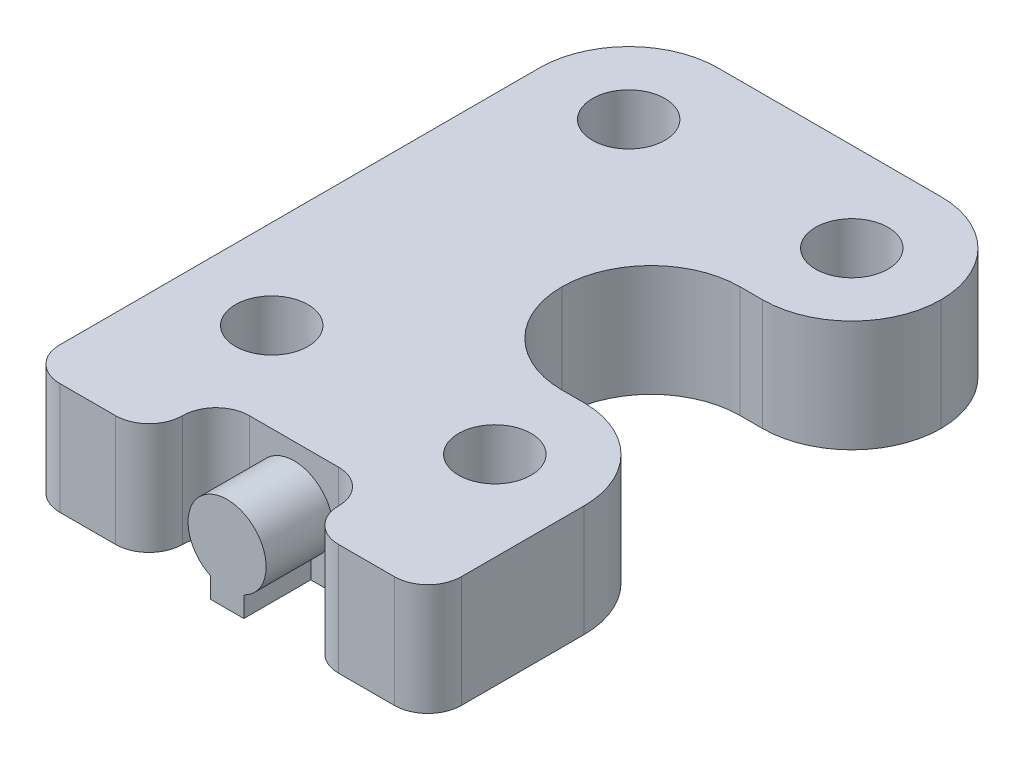
ISO-10303-21;
HEADER;
FILE_DESCRIPTION(('STEP AP214'),'2;1');
FILE_NAME('part.step','',(''),(''),'','','');
FILE_SCHEMA(('AUTOMOTIVE_DESIGN { 1 0 10303 214 1 1 1 1 }'));
ENDSEC;
DATA;
#1=APPLICATION_CONTEXT('core data for automotive mechanical design processes');
#2=APPLICATION_PROTOCOL_DEFINITION('international standard','automotive_design',2000,#1);
#3=PRODUCT_CONTEXT('',#1,'mechanical');
#4=PRODUCT('Part','Part','',(#3));
#5=PRODUCT_RELATED_PRODUCT_CATEGORY('part','',(#4));
#6=PRODUCT_DEFINITION_FORMATION('','',#4);
#7=PRODUCT_DEFINITION_CONTEXT('part definition',#1,'design');
#8=PRODUCT_DEFINITION('design','',#6,#7);
#9=PRODUCT_DEFINITION_SHAPE('','',#8);
#10=(LENGTH_UNIT() NAMED_UNIT(*) SI_UNIT(.MILLI.,.METRE.));
#11=(NAMED_UNIT(*) PLANE_ANGLE_UNIT() SI_UNIT($,.RADIAN.));
#12=(NAMED_UNIT(*) SI_UNIT($,.STERADIAN.) SOLID_ANGLE_UNIT());
#13=UNCERTAINTY_MEASURE_WITH_UNIT(LENGTH_MEASURE(1.E-05),#10,'distance_accuracy_value','');
#14=(GEOMETRIC_REPRESENTATION_CONTEXT(3) GLOBAL_UNCERTAINTY_ASSIGNED_CONTEXT((#13)) GLOBAL_UNIT_ASSIGNED_CONTEXT((#10,
#11,#12)) REPRESENTATION_CONTEXT('',''));
#15=CARTESIAN_POINT('',(0.,0.,0.));
#16=DIRECTION('',(0.,0.,1.));
#17=DIRECTION('',(1.,0.,0.));
#18=AXIS2_PLACEMENT_3D('',#15,#16,#17);
#19=CARTESIAN_POINT('',(0.,5.,0.));
#20=DIRECTION('',(0.,-1.,0.));
#21=DIRECTION('',(0.,0.,-1.));
#22=AXIS2_PLACEMENT_3D('',#19,#20,#21);
#23=PLANE('',#22);
#24=DIRECTION('',(1.,0.,0.));
#25=VECTOR('',#24,1.);
#26=CARTESIAN_POINT('',(12.5,5.,0.));
#27=LINE('',#26,#25);
#28=CARTESIAN_POINT('',(14.,5.,0.));
#29=VERTEX_POINT('',#28);
#30=CARTESIAN_POINT('',(16.5,5.,0.));
#31=VERTEX_POINT('',#30);
#32=EDGE_CURVE('E265',#29,#31,#27,.T.);
#33=ORIENTED_EDGE('',*,*,#32,.T.);
#34=CARTESIAN_POINT('',(16.5,5.,-1.5));
#35=DIRECTION('',(0.,-1.,0.));
#36=DIRECTION('',(0.,0.,-1.));
#37=AXIS2_PLACEMENT_3D('',#34,#35,#36);
#38=CIRCLE('',#37,1.5);
#39=CARTESIAN_POINT('',(18.,5.,-1.5));
#40=VERTEX_POINT('',#39);
#41=EDGE_CURVE('E377',#31,#40,#38,.F.);
#42=ORIENTED_EDGE('',*,*,#41,.T.);
#43=DIRECTION('',(0.,0.,-1.));
#44=VECTOR('',#43,1.);
#45=CARTESIAN_POINT('',(18.,5.,0.));
#46=LINE('',#45,#44);
#47=CARTESIAN_POINT('',(18.,5.,-7.));
#48=VERTEX_POINT('',#47);
#49=EDGE_CURVE('E268',#40,#48,#46,.T.);
#50=ORIENTED_EDGE('',*,*,#49,.T.);
#51=CARTESIAN_POINT('',(14.,5.,-7.));
#52=DIRECTION('',(0.,-1.,0.));
#53=DIRECTION('',(0.,0.,-1.));
#54=AXIS2_PLACEMENT_3D('',#51,#52,#53);
#55=CIRCLE('',#54,4.);
#56=CARTESIAN_POINT('',(14.,5.,-11.));
#57=VERTEX_POINT('',#56);
#58=EDGE_CURVE('E327',#48,#57,#55,.F.);
#59=ORIENTED_EDGE('',*,*,#58,.T.);
#60=DIRECTION('',(-1.,0.,0.));
#61=VECTOR('',#60,1.);
#62=CARTESIAN_POINT('',(18.,5.,-11.));
#63=LINE('',#62,#61);
#64=CARTESIAN_POINT('',(13.,5.,-11.));
#65=VERTEX_POINT('',#64);
#66=EDGE_CURVE('E270',#57,#65,#63,.T.);
#67=ORIENTED_EDGE('',*,*,#66,.T.);
#68=CARTESIAN_POINT('',(13.,5.,-15.));
#69=DIRECTION('',(0.,-1.,0.));
#70=DIRECTION('',(0.,0.,-1.));
#71=AXIS2_PLACEMENT_3D('',#68,#69,#70);
#72=CIRCLE('',#71,4.);
#73=CARTESIAN_POINT('',(9.,5.,-15.));
#74=VERTEX_POINT('',#73);
#75=EDGE_CURVE('E339',#65,#74,#72,.T.);
#76=ORIENTED_EDGE('',*,*,#75,.T.);
#77=CARTESIAN_POINT('',(13.,5.,-15.));
#78=DIRECTION('',(0.,-1.,0.));
#79=DIRECTION('',(0.,0.,-1.));
#80=AXIS2_PLACEMENT_3D('',#77,#78,#79);
#81=CIRCLE('',#80,4.);
#82=CARTESIAN_POINT('',(13.,5.,-19.));
#83=VERTEX_POINT('',#82);
#84=EDGE_CURVE('E343',#74,#83,#81,.T.);
#85=ORIENTED_EDGE('',*,*,#84,.T.);
#86=DIRECTION('',(1.,0.,0.));
#87=VECTOR('',#86,1.);
#88=CARTESIAN_POINT('',(18.,5.,-19.));
#89=LINE('',#88,#87);
#90=CARTESIAN_POINT('',(14.,5.,-19.));
#91=VERTEX_POINT('',#90);
#92=EDGE_CURVE('E273',#83,#91,#89,.T.);
#93=ORIENTED_EDGE('',*,*,#92,.T.);
#94=CARTESIAN_POINT('',(14.,5.,-23.));
#95=DIRECTION('',(0.,-1.,0.));
#96=DIRECTION('',(0.,0.,-1.));
#97=AXIS2_PLACEMENT_3D('',#94,#95,#96);
#98=CIRCLE('',#97,4.);
#99=CARTESIAN_POINT('',(18.,5.,-23.));
#100=VERTEX_POINT('',#99);
#101=EDGE_CURVE('E321',#91,#100,#98,.F.);
#102=ORIENTED_EDGE('',*,*,#101,.T.);
#103=CARTESIAN_POINT('',(14.,5.,-23.));
#104=DIRECTION('',(0.,-1.,0.));
#105=DIRECTION('',(0.,0.,-1.));
#106=AXIS2_PLACEMENT_3D('',#103,#104,#105);
#107=CIRCLE('',#106,4.);
#108=CARTESIAN_POINT('',(14.,5.,-27.));
#109=VERTEX_POINT('',#108);
#110=EDGE_CURVE('E323',#100,#109,#107,.F.);
#111=ORIENTED_EDGE('',*,*,#110,.T.);
#112=DIRECTION('',(-1.,0.,0.));
#113=VECTOR('',#112,1.);
#114=CARTESIAN_POINT('',(0.,5.,-27.));
#115=LINE('',#114,#113);
#116=CARTESIAN_POINT('',(4.,5.,-27.));
#117=VERTEX_POINT('',#116);
#118=EDGE_CURVE('E276',#109,#117,#115,.T.);
#119=ORIENTED_EDGE('',*,*,#118,.T.);
#120=CARTESIAN_POINT('',(4.,5.,-23.));
#121=DIRECTION('',(0.,-1.,0.));
#122=DIRECTION('',(0.,0.,-1.));
#123=AXIS2_PLACEMENT_3D('',#120,#121,#122);
#124=CIRCLE('',#123,4.);
#125=CARTESIAN_POINT('',(0.,5.,-23.));
#126=VERTEX_POINT('',#125);
#127=EDGE_CURVE('E325',#117,#126,#124,.F.);
#128=ORIENTED_EDGE('',*,*,#127,.T.);
#129=DIRECTION('',(0.,0.,1.));
#130=VECTOR('',#129,1.);
#131=CARTESIAN_POINT('',(0.,5.,0.));
#132=LINE('',#131,#130);
#133=CARTESIAN_POINT('',(0.,5.,-1.5));
#134=VERTEX_POINT('',#133);
#135=EDGE_CURVE('E255',#126,#134,#132,.T.);
#136=ORIENTED_EDGE('',*,*,#135,.T.);
#137=CARTESIAN_POINT('',(1.5,5.,-1.5));
#138=DIRECTION('',(0.,-1.,0.));
#139=DIRECTION('',(0.,0.,-1.));
#140=AXIS2_PLACEMENT_3D('',#137,#138,#139);
#141=CIRCLE('',#140,1.5);
#142=CARTESIAN_POINT('',(1.5,5.,0.));
#143=VERTEX_POINT('',#142);
#144=EDGE_CURVE('E371',#134,#143,#141,.F.);
#145=ORIENTED_EDGE('',*,*,#144,.T.);
#146=DIRECTION('',(1.,0.,0.));
#147=VECTOR('',#146,1.);
#148=CARTESIAN_POINT('',(0.,5.,0.));
#149=LINE('',#148,#147);
#150=CARTESIAN_POINT('',(4.,5.,0.));
#151=VERTEX_POINT('',#150);
#152=EDGE_CURVE('E258',#143,#151,#149,.T.);
#153=ORIENTED_EDGE('',*,*,#152,.T.);
#154=CARTESIAN_POINT('',(4.,5.,-1.5));
#155=DIRECTION('',(0.,-1.,0.));
#156=DIRECTION('',(0.,0.,-1.));
#157=AXIS2_PLACEMENT_3D('',#154,#155,#156);
#158=CIRCLE('',#157,1.5);
#159=CARTESIAN_POINT('',(5.5,5.,-1.5));
#160=VERTEX_POINT('',#159);
#161=EDGE_CURVE('E373',#151,#160,#158,.F.);
#162=ORIENTED_EDGE('',*,*,#161,.T.);
#163=CARTESIAN_POINT('',(7.,5.,-1.5));
#164=DIRECTION('',(0.,-1.,0.));
#165=DIRECTION('',(0.,0.,-1.));
#166=AXIS2_PLACEMENT_3D('',#163,#164,#165);
#167=CIRCLE('',#166,1.5);
#168=CARTESIAN_POINT('',(7.,5.,-3.));
#169=VERTEX_POINT('',#168);
#170=EDGE_CURVE('E11',#160,#169,#167,.T.);
#171=ORIENTED_EDGE('',*,*,#170,.T.);
#172=DIRECTION('',(1.,0.,0.));
#173=VECTOR('',#172,1.);
#174=CARTESIAN_POINT('',(5.5,5.,-3.));
#175=LINE('',#174,#173);
#176=CARTESIAN_POINT('',(11.,5.,-3.));
#177=VERTEX_POINT('',#176);
#178=EDGE_CURVE('E262',#169,#177,#175,.T.);
#179=ORIENTED_EDGE('',*,*,#178,.T.);
#180=CARTESIAN_POINT('',(11.,5.,-1.5));
#181=DIRECTION('',(0.,-1.,0.));
#182=DIRECTION('',(0.,0.,-1.));
#183=AXIS2_PLACEMENT_3D('',#180,#181,#182);
#184=CIRCLE('',#183,1.5);
#185=CARTESIAN_POINT('',(12.5,5.,-1.5));
#186=VERTEX_POINT('',#185);
#187=EDGE_CURVE('E389',#177,#186,#184,.T.);
#188=ORIENTED_EDGE('',*,*,#187,.T.);
#189=CARTESIAN_POINT('',(14.,5.,-1.5));
#190=DIRECTION('',(0.,-1.,0.));
#191=DIRECTION('',(0.,0.,-1.));
#192=AXIS2_PLACEMENT_3D('',#189,#190,#191);
#193=CIRCLE('',#192,1.5);
#194=EDGE_CURVE('E375',#186,#29,#193,.F.);
#195=ORIENTED_EDGE('',*,*,#194,.T.);
#196=EDGE_LOOP('',(#33,#42,#50,#59,#67,#76,#85,#93,#102,#111,#119,#128,#136,#145,#153,#162,#171,
#179,#188,#195));
#197=FACE_BOUND('',#196,.T.);
#198=CARTESIAN_POINT('',(4.,5.,-23.));
#199=DIRECTION('',(0.,1.,0.));
#200=DIRECTION('',(0.,0.,1.));
#201=AXIS2_PLACEMENT_3D('',#198,#199,#200);
#202=CIRCLE('',#201,1.625);
#203=CARTESIAN_POINT('',(4.,5.,-21.375));
#204=VERTEX_POINT('',#203);
#205=EDGE_CURVE('E249',#204,#204,#202,.T.);
#206=ORIENTED_EDGE('',*,*,#205,.F.);
#207=EDGE_LOOP('',(#206));
#208=FACE_BOUND('',#207,.T.);
#209=CARTESIAN_POINT('',(14.,5.,-23.));
#210=DIRECTION('',(0.,1.,0.));
#211=DIRECTION('',(0.,0.,1.));
#212=AXIS2_PLACEMENT_3D('',#209,#210,#211);
#213=CIRCLE('',#212,1.625);
#214=CARTESIAN_POINT('',(14.,5.,-21.375));
#215=VERTEX_POINT('',#214);
#216=EDGE_CURVE('E243',#215,#215,#213,.T.);
#217=ORIENTED_EDGE('',*,*,#216,.F.);
#218=EDGE_LOOP('',(#217));
#219=FACE_BOUND('',#218,.T.);
#220=CARTESIAN_POINT('',(14.,5.,-7.));
#221=DIRECTION('',(0.,1.,0.));
#222=DIRECTION('',(0.,0.,1.));
#223=AXIS2_PLACEMENT_3D('',#220,#221,#222);
#224=CIRCLE('',#223,1.625);
#225=CARTESIAN_POINT('',(14.,5.,-5.375));
#226=VERTEX_POINT('',#225);
#227=EDGE_CURVE('E237',#226,#226,#224,.T.);
#228=ORIENTED_EDGE('',*,*,#227,.F.);
#229=EDGE_LOOP('',(#228));
#230=FACE_BOUND('',#229,.T.);
#231=CARTESIAN_POINT('',(4.,5.,-7.));
#232=DIRECTION('',(0.,1.,0.));
#233=DIRECTION('',(0.,0.,1.));
#234=AXIS2_PLACEMENT_3D('',#231,#232,#233);
#235=CIRCLE('',#234,1.625);
#236=CARTESIAN_POINT('',(4.,5.,-5.375));
#237=VERTEX_POINT('',#236);
#238=EDGE_CURVE('E229',#237,#237,#235,.T.);
#239=ORIENTED_EDGE('',*,*,#238,.F.);
#240=EDGE_LOOP('',(#239));
#241=FACE_BOUND('',#240,.T.);
#242=ADVANCED_FACE('F33',(#197,#208,#219,#230,#241),#23,.F.);
#243=CARTESIAN_POINT('',(0.,0.,0.));
#244=DIRECTION('',(0.,-1.,0.));
#245=DIRECTION('',(0.,0.,-1.));
#246=AXIS2_PLACEMENT_3D('',#243,#244,#245);
#247=PLANE('',#246);
#248=CARTESIAN_POINT('',(14.,0.,-7.));
#249=DIRECTION('',(0.,1.,0.));
#250=DIRECTION('',(0.,0.,1.));
#251=AXIS2_PLACEMENT_3D('',#248,#249,#250);
#252=CIRCLE('',#251,1.625);
#253=CARTESIAN_POINT('',(14.,0.,-5.375));
#254=VERTEX_POINT('',#253);
#255=EDGE_CURVE('E232',#254,#254,#252,.T.);
#256=ORIENTED_EDGE('',*,*,#255,.T.);
#257=EDGE_LOOP('',(#256));
#258=FACE_BOUND('',#257,.T.);
#259=CARTESIAN_POINT('',(4.,0.,-23.));
#260=DIRECTION('',(0.,1.,0.));
#261=DIRECTION('',(0.,0.,1.));
#262=AXIS2_PLACEMENT_3D('',#259,#260,#261);
#263=CIRCLE('',#262,1.625);
#264=CARTESIAN_POINT('',(4.,0.,-21.375));
#265=VERTEX_POINT('',#264);
#266=EDGE_CURVE('E246',#265,#265,#263,.T.);
#267=ORIENTED_EDGE('',*,*,#266,.T.);
#268=EDGE_LOOP('',(#267));
#269=FACE_BOUND('',#268,.T.);
#270=DIRECTION('',(0.,0.,-1.));
#271=VECTOR('',#270,1.);
#272=CARTESIAN_POINT('',(18.,0.,0.));
#273=LINE('',#272,#271);
#274=CARTESIAN_POINT('',(18.,0.,-1.5));
#275=VERTEX_POINT('',#274);
#276=CARTESIAN_POINT('',(18.,0.,-7.));
#277=VERTEX_POINT('',#276);
#278=EDGE_CURVE('E290',#275,#277,#273,.T.);
#279=ORIENTED_EDGE('',*,*,#278,.F.);
#280=CARTESIAN_POINT('',(16.5,0.,-1.5));
#281=DIRECTION('',(0.,-1.,0.));
#282=DIRECTION('',(0.,0.,-1.));
#283=AXIS2_PLACEMENT_3D('',#280,#281,#282);
#284=CIRCLE('',#283,1.5);
#285=CARTESIAN_POINT('',(16.5,0.,0.));
#286=VERTEX_POINT('',#285);
#287=EDGE_CURVE('E365',#275,#286,#284,.T.);
#288=ORIENTED_EDGE('',*,*,#287,.T.);
#289=DIRECTION('',(1.,0.,0.));
#290=VECTOR('',#289,1.);
#291=CARTESIAN_POINT('',(12.5,0.,0.));
#292=LINE('',#291,#290);
#293=CARTESIAN_POINT('',(14.,0.,0.));
#294=VERTEX_POINT('',#293);
#295=EDGE_CURVE('E287',#294,#286,#292,.T.);
#296=ORIENTED_EDGE('',*,*,#295,.F.);
#297=CARTESIAN_POINT('',(14.,0.,-1.5));
#298=DIRECTION('',(0.,-1.,0.));
#299=DIRECTION('',(0.,0.,-1.));
#300=AXIS2_PLACEMENT_3D('',#297,#298,#299);
#301=CIRCLE('',#300,1.5);
#302=CARTESIAN_POINT('',(12.5,0.,-1.5));
#303=VERTEX_POINT('',#302);
#304=EDGE_CURVE('E363',#294,#303,#301,.T.);
#305=ORIENTED_EDGE('',*,*,#304,.T.);
#306=CARTESIAN_POINT('',(11.,0.,-1.5));
#307=DIRECTION('',(0.,-1.,0.));
#308=DIRECTION('',(0.,0.,-1.));
#309=AXIS2_PLACEMENT_3D('',#306,#307,#308);
#310=CIRCLE('',#309,1.5);
#311=CARTESIAN_POINT('',(11.,0.,-3.));
#312=VERTEX_POINT('',#311);
#313=EDGE_CURVE('E386',#303,#312,#310,.F.);
#314=ORIENTED_EDGE('',*,*,#313,.T.);
#315=DIRECTION('',(1.,0.,0.));
#316=VECTOR('',#315,1.);
#317=CARTESIAN_POINT('',(5.5,0.,-3.));
#318=LINE('',#317,#316);
#319=CARTESIAN_POINT('',(9.75,0.,-3.));
#320=VERTEX_POINT('',#319);
#321=EDGE_CURVE('E285',#320,#312,#318,.T.);
#322=ORIENTED_EDGE('',*,*,#321,.F.);
#323=DIRECTION('',(0.,0.,-1.));
#324=VECTOR('',#323,1.);
#325=CARTESIAN_POINT('',(9.75,0.,5.50567888638631));
#326=LINE('',#325,#324);
#327=CARTESIAN_POINT('',(9.75,0.,0.));
#328=VERTEX_POINT('',#327);
#329=EDGE_CURVE('E222',#328,#320,#326,.T.);
#330=ORIENTED_EDGE('',*,*,#329,.F.);
#331=DIRECTION('',(-1.,0.,0.));
#332=VECTOR('',#331,1.);
#333=CARTESIAN_POINT('',(8.25,0.,0.));
#334=LINE('',#333,#332);
#335=CARTESIAN_POINT('',(8.25,0.,0.));
#336=VERTEX_POINT('',#335);
#337=EDGE_CURVE('E228',#328,#336,#334,.T.);
#338=ORIENTED_EDGE('',*,*,#337,.T.);
#339=DIRECTION('',(0.,0.,-1.));
#340=VECTOR('',#339,1.);
#341=CARTESIAN_POINT('',(8.25,0.,5.50567888638631));
#342=LINE('',#341,#340);
#343=CARTESIAN_POINT('',(8.25,0.,-3.));
#344=VERTEX_POINT('',#343);
#345=EDGE_CURVE('E210',#336,#344,#342,.T.);
#346=ORIENTED_EDGE('',*,*,#345,.T.);
#347=CARTESIAN_POINT('',(7.,0.,-3.));
#348=VERTEX_POINT('',#347);
#349=EDGE_CURVE('E197',#348,#344,#318,.T.);
#350=ORIENTED_EDGE('',*,*,#349,.F.);
#351=CARTESIAN_POINT('',(7.,0.,-1.5));
#352=DIRECTION('',(0.,-1.,0.));
#353=DIRECTION('',(0.,0.,-1.));
#354=AXIS2_PLACEMENT_3D('',#351,#352,#353);
#355=CIRCLE('',#354,1.5);
#356=CARTESIAN_POINT('',(5.5,0.,-1.5));
#357=VERTEX_POINT('',#356);
#358=EDGE_CURVE('E42',#348,#357,#355,.F.);
#359=ORIENTED_EDGE('',*,*,#358,.T.);
#360=CARTESIAN_POINT('',(4.,0.,-1.5));
#361=DIRECTION('',(0.,-1.,0.));
#362=DIRECTION('',(0.,0.,-1.));
#363=AXIS2_PLACEMENT_3D('',#360,#361,#362);
#364=CIRCLE('',#363,1.5);
#365=CARTESIAN_POINT('',(4.,0.,0.));
#366=VERTEX_POINT('',#365);
#367=EDGE_CURVE('E361',#357,#366,#364,.T.);
#368=ORIENTED_EDGE('',*,*,#367,.T.);
#369=DIRECTION('',(1.,0.,0.));
#370=VECTOR('',#369,1.);
#371=CARTESIAN_POINT('',(0.,0.,0.));
#372=LINE('',#371,#370);
#373=CARTESIAN_POINT('',(1.5,0.,0.));
#374=VERTEX_POINT('',#373);
#375=EDGE_CURVE('E282',#374,#366,#372,.T.);
#376=ORIENTED_EDGE('',*,*,#375,.F.);
#377=CARTESIAN_POINT('',(1.5,0.,-1.5));
#378=DIRECTION('',(0.,-1.,0.));
#379=DIRECTION('',(0.,0.,-1.));
#380=AXIS2_PLACEMENT_3D('',#377,#378,#379);
#381=CIRCLE('',#380,1.5);
#382=CARTESIAN_POINT('',(0.,0.,-1.5));
#383=VERTEX_POINT('',#382);
#384=EDGE_CURVE('E359',#374,#383,#381,.T.);
#385=ORIENTED_EDGE('',*,*,#384,.T.);
#386=DIRECTION('',(0.,0.,1.));
#387=VECTOR('',#386,1.);
#388=CARTESIAN_POINT('',(0.,0.,0.));
#389=LINE('',#388,#387);
#390=CARTESIAN_POINT('',(0.,0.,-23.));
#391=VERTEX_POINT('',#390);
#392=EDGE_CURVE('E252',#391,#383,#389,.T.);
#393=ORIENTED_EDGE('',*,*,#392,.F.);
#394=CARTESIAN_POINT('',(4.,0.,-23.));
#395=DIRECTION('',(0.,-1.,0.));
#396=DIRECTION('',(0.,0.,-1.));
#397=AXIS2_PLACEMENT_3D('',#394,#395,#396);
#398=CIRCLE('',#397,4.);
#399=CARTESIAN_POINT('',(4.,0.,-27.));
#400=VERTEX_POINT('',#399);
#401=EDGE_CURVE('E313',#391,#400,#398,.T.);
#402=ORIENTED_EDGE('',*,*,#401,.T.);
#403=DIRECTION('',(-1.,0.,0.));
#404=VECTOR('',#403,1.);
#405=CARTESIAN_POINT('',(0.,0.,-27.));
#406=LINE('',#405,#404);
#407=CARTESIAN_POINT('',(14.,0.,-27.));
#408=VERTEX_POINT('',#407);
#409=EDGE_CURVE('E259',#408,#400,#406,.T.);
#410=ORIENTED_EDGE('',*,*,#409,.F.);
#411=CARTESIAN_POINT('',(14.,0.,-23.));
#412=DIRECTION('',(0.,-1.,0.));
#413=DIRECTION('',(0.,0.,-1.));
#414=AXIS2_PLACEMENT_3D('',#411,#412,#413);
#415=CIRCLE('',#414,4.);
#416=CARTESIAN_POINT('',(18.,0.,-23.));
#417=VERTEX_POINT('',#416);
#418=EDGE_CURVE('E311',#408,#417,#415,.T.);
#419=ORIENTED_EDGE('',*,*,#418,.T.);
#420=CARTESIAN_POINT('',(14.,0.,-23.));
#421=DIRECTION('',(0.,-1.,0.));
#422=DIRECTION('',(0.,0.,-1.));
#423=AXIS2_PLACEMENT_3D('',#420,#421,#422);
#424=CIRCLE('',#423,4.);
#425=CARTESIAN_POINT('',(14.,0.,-19.));
#426=VERTEX_POINT('',#425);
#427=EDGE_CURVE('E309',#417,#426,#424,.T.);
#428=ORIENTED_EDGE('',*,*,#427,.T.);
#429=DIRECTION('',(1.,0.,0.));
#430=VECTOR('',#429,1.);
#431=CARTESIAN_POINT('',(18.,0.,-19.));
#432=LINE('',#431,#430);
#433=CARTESIAN_POINT('',(13.,0.,-19.));
#434=VERTEX_POINT('',#433);
#435=EDGE_CURVE('E295',#434,#426,#432,.T.);
#436=ORIENTED_EDGE('',*,*,#435,.F.);
#437=CARTESIAN_POINT('',(13.,0.,-15.));
#438=DIRECTION('',(0.,-1.,0.));
#439=DIRECTION('',(0.,0.,-1.));
#440=AXIS2_PLACEMENT_3D('',#437,#438,#439);
#441=CIRCLE('',#440,4.);
#442=CARTESIAN_POINT('',(9.,0.,-15.));
#443=VERTEX_POINT('',#442);
#444=EDGE_CURVE('E341',#434,#443,#441,.F.);
#445=ORIENTED_EDGE('',*,*,#444,.T.);
#446=CARTESIAN_POINT('',(13.,0.,-15.));
#447=DIRECTION('',(0.,-1.,0.));
#448=DIRECTION('',(0.,0.,-1.));
#449=AXIS2_PLACEMENT_3D('',#446,#447,#448);
#450=CIRCLE('',#449,4.);
#451=CARTESIAN_POINT('',(13.,0.,-11.));
#452=VERTEX_POINT('',#451);
#453=EDGE_CURVE('E337',#443,#452,#450,.F.);
#454=ORIENTED_EDGE('',*,*,#453,.T.);
#455=DIRECTION('',(-1.,0.,0.));
#456=VECTOR('',#455,1.);
#457=CARTESIAN_POINT('',(18.,0.,-11.));
#458=LINE('',#457,#456);
#459=CARTESIAN_POINT('',(14.,0.,-11.));
#460=VERTEX_POINT('',#459);
#461=EDGE_CURVE('E292',#460,#452,#458,.T.);
#462=ORIENTED_EDGE('',*,*,#461,.F.);
#463=CARTESIAN_POINT('',(14.,0.,-7.));
#464=DIRECTION('',(0.,-1.,0.));
#465=DIRECTION('',(0.,0.,-1.));
#466=AXIS2_PLACEMENT_3D('',#463,#464,#465);
#467=CIRCLE('',#466,4.);
#468=EDGE_CURVE('E315',#460,#277,#467,.T.);
#469=ORIENTED_EDGE('',*,*,#468,.T.);
#470=EDGE_LOOP('',(#279,#288,#296,#305,#314,#322,#330,#338,#346,#350,#359,#368,#376,#385,#393,
#402,#410,#419,#428,#436,#445,#454,#462,#469));
#471=FACE_BOUND('',#470,.T.);
#472=CARTESIAN_POINT('',(14.,0.,-23.));
#473=DIRECTION('',(0.,1.,0.));
#474=DIRECTION('',(0.,0.,1.));
#475=AXIS2_PLACEMENT_3D('',#472,#473,#474);
#476=CIRCLE('',#475,1.625);
#477=CARTESIAN_POINT('',(14.,0.,-21.375));
#478=VERTEX_POINT('',#477);
#479=EDGE_CURVE('E240',#478,#478,#476,.T.);
#480=ORIENTED_EDGE('',*,*,#479,.T.);
#481=EDGE_LOOP('',(#480));
#482=FACE_BOUND('',#481,.T.);
#483=CARTESIAN_POINT('',(4.,0.,-7.));
#484=DIRECTION('',(0.,1.,0.));
#485=DIRECTION('',(0.,0.,1.));
#486=AXIS2_PLACEMENT_3D('',#483,#484,#485);
#487=CIRCLE('',#486,1.625);
#488=CARTESIAN_POINT('',(4.,0.,-5.375));
#489=VERTEX_POINT('',#488);
#490=EDGE_CURVE('E233',#489,#489,#487,.T.);
#491=ORIENTED_EDGE('',*,*,#490,.T.);
#492=EDGE_LOOP('',(#491));
#493=FACE_BOUND('',#492,.T.);
#494=ADVANCED_FACE('F404',(#258,#269,#471,#482,#493),#247,.T.);
#495=CARTESIAN_POINT('',(0.,5.,0.));
#496=DIRECTION('',(1.,0.,0.));
#497=DIRECTION('',(0.,0.,-1.));
#498=AXIS2_PLACEMENT_3D('',#495,#496,#497);
#499=PLANE('',#498);
#500=ORIENTED_EDGE('',*,*,#392,.T.);
#501=DIRECTION('',(0.,-1.,0.));
#502=VECTOR('',#501,1.);
#503=CARTESIAN_POINT('',(0.,5.,-1.5));
#504=LINE('',#503,#502);
#505=EDGE_CURVE('E384',#383,#134,#504,.F.);
#506=ORIENTED_EDGE('',*,*,#505,.T.);
#507=ORIENTED_EDGE('',*,*,#135,.F.);
#508=DIRECTION('',(0.,-1.,0.));
#509=VECTOR('',#508,1.);
#510=CARTESIAN_POINT('',(0.,5.,-23.));
#511=LINE('',#510,#509);
#512=EDGE_CURVE('E329',#126,#391,#511,.T.);
#513=ORIENTED_EDGE('',*,*,#512,.T.);
#514=EDGE_LOOP('',(#500,#506,#507,#513));
#515=FACE_BOUND('',#514,.T.);
#516=ADVANCED_FACE('F426',(#515),#499,.F.);
#517=CARTESIAN_POINT('',(0.,5.,0.));
#518=DIRECTION('',(0.,0.,-1.));
#519=DIRECTION('',(-1.,0.,0.));
#520=AXIS2_PLACEMENT_3D('',#517,#518,#519);
#521=PLANE('',#520);
#522=ORIENTED_EDGE('',*,*,#375,.T.);
#523=DIRECTION('',(0.,-1.,0.));
#524=VECTOR('',#523,1.);
#525=CARTESIAN_POINT('',(4.,5.,0.));
#526=LINE('',#525,#524);
#527=EDGE_CURVE('E382',#366,#151,#526,.F.);
#528=ORIENTED_EDGE('',*,*,#527,.T.);
#529=ORIENTED_EDGE('',*,*,#152,.F.);
#530=DIRECTION('',(0.,-1.,0.));
#531=VECTOR('',#530,1.);
#532=CARTESIAN_POINT('',(1.5,5.,0.));
#533=LINE('',#532,#531);
#534=EDGE_CURVE('E379',#143,#374,#533,.T.);
#535=ORIENTED_EDGE('',*,*,#534,.T.);
#536=EDGE_LOOP('',(#522,#528,#529,#535));
#537=FACE_BOUND('',#536,.T.);
#538=ADVANCED_FACE('F456',(#537),#521,.F.);
#539=CARTESIAN_POINT('',(5.5,5.,-3.));
#540=DIRECTION('',(0.,0.,-1.));
#541=DIRECTION('',(-1.,0.,0.));
#542=AXIS2_PLACEMENT_3D('',#539,#540,#541);
#543=PLANE('',#542);
#544=DIRECTION('',(0.,1.,0.));
#545=VECTOR('',#544,1.);
#546=CARTESIAN_POINT('',(9.75,0.918861169915811,-3.));
#547=LINE('',#546,#545);
#548=CARTESIAN_POINT('',(9.75,0.91886116991581,-3.));
#549=VERTEX_POINT('',#548);
#550=EDGE_CURVE('E55',#320,#549,#547,.T.);
#551=ORIENTED_EDGE('',*,*,#550,.F.);
#552=ORIENTED_EDGE('',*,*,#321,.T.);
#553=DIRECTION('',(0.,-1.,0.));
#554=VECTOR('',#553,1.);
#555=CARTESIAN_POINT('',(11.,5.,-3.));
#556=LINE('',#555,#554);
#557=EDGE_CURVE('E353',#312,#177,#556,.F.);
#558=ORIENTED_EDGE('',*,*,#557,.T.);
#559=ORIENTED_EDGE('',*,*,#178,.F.);
#560=DIRECTION('',(0.,-1.,0.));
#561=VECTOR('',#560,1.);
#562=CARTESIAN_POINT('',(7.,0.,-3.));
#563=LINE('',#562,#561);
#564=EDGE_CURVE('E345',#169,#348,#563,.T.);
#565=ORIENTED_EDGE('',*,*,#564,.T.);
#566=ORIENTED_EDGE('',*,*,#349,.T.);
#567=DIRECTION('',(0.,-1.,0.));
#568=VECTOR('',#567,1.);
#569=CARTESIAN_POINT('',(8.25,0.91886116991581,-3.));
#570=LINE('',#569,#568);
#571=CARTESIAN_POINT('',(8.25,0.91886116991581,-3.));
#572=VERTEX_POINT('',#571);
#573=EDGE_CURVE('E192',#572,#344,#570,.T.);
#574=ORIENTED_EDGE('',*,*,#573,.F.);
#575=CARTESIAN_POINT('',(9.,2.5,-3.));
#576=DIRECTION('',(0.,0.,1.));
#577=DIRECTION('',(1.,0.,0.));
#578=AXIS2_PLACEMENT_3D('',#575,#576,#577);
#579=CIRCLE('',#578,1.75);
#580=EDGE_CURVE('E50',#549,#572,#579,.T.);
#581=ORIENTED_EDGE('',*,*,#580,.F.);
#582=EDGE_LOOP('',(#551,#552,#558,#559,#565,#566,#574,#581));
#583=FACE_BOUND('',#582,.T.);
#584=ADVANCED_FACE('F194',(#583),#543,.F.);
#585=CARTESIAN_POINT('',(12.5,5.,0.));
#586=DIRECTION('',(0.,0.,-1.));
#587=DIRECTION('',(-1.,0.,0.));
#588=AXIS2_PLACEMENT_3D('',#585,#586,#587);
#589=PLANE('',#588);
#590=ORIENTED_EDGE('',*,*,#295,.T.);
#591=DIRECTION('',(0.,-1.,0.));
#592=VECTOR('',#591,1.);
#593=CARTESIAN_POINT('',(16.5,5.,0.));
#594=LINE('',#593,#592);
#595=EDGE_CURVE('E369',#286,#31,#594,.F.);
#596=ORIENTED_EDGE('',*,*,#595,.T.);
#597=ORIENTED_EDGE('',*,*,#32,.F.);
#598=DIRECTION('',(0.,-1.,0.));
#599=VECTOR('',#598,1.);
#600=CARTESIAN_POINT('',(14.,5.,0.));
#601=LINE('',#600,#599);
#602=EDGE_CURVE('E367',#29,#294,#601,.T.);
#603=ORIENTED_EDGE('',*,*,#602,.T.);
#604=EDGE_LOOP('',(#590,#596,#597,#603));
#605=FACE_BOUND('',#604,.T.);
#606=ADVANCED_FACE('F449',(#605),#589,.F.);
#607=CARTESIAN_POINT('',(18.,5.,0.));
#608=DIRECTION('',(-1.,0.,0.));
#609=DIRECTION('',(0.,0.,1.));
#610=AXIS2_PLACEMENT_3D('',#607,#608,#609);
#611=PLANE('',#610);
#612=ORIENTED_EDGE('',*,*,#49,.F.);
#613=DIRECTION('',(0.,-1.,0.));
#614=VECTOR('',#613,1.);
#615=CARTESIAN_POINT('',(18.,5.,-1.5));
#616=LINE('',#615,#614);
#617=EDGE_CURVE('E356',#40,#275,#616,.T.);
#618=ORIENTED_EDGE('',*,*,#617,.T.);
#619=ORIENTED_EDGE('',*,*,#278,.T.);
#620=DIRECTION('',(0.,-1.,0.));
#621=VECTOR('',#620,1.);
#622=CARTESIAN_POINT('',(18.,5.,-7.));
#623=LINE('',#622,#621);
#624=EDGE_CURVE('E318',#277,#48,#623,.F.);
#625=ORIENTED_EDGE('',*,*,#624,.T.);
#626=EDGE_LOOP('',(#612,#618,#619,#625));
#627=FACE_BOUND('',#626,.T.);
#628=ADVANCED_FACE('F445',(#627),#611,.F.);
#629=CARTESIAN_POINT('',(18.,5.,-11.));
#630=DIRECTION('',(0.,0.,1.));
#631=DIRECTION('',(1.,0.,0.));
#632=AXIS2_PLACEMENT_3D('',#629,#630,#631);
#633=PLANE('',#632);
#634=ORIENTED_EDGE('',*,*,#461,.T.);
#635=DIRECTION('',(0.,-1.,0.));
#636=VECTOR('',#635,1.);
#637=CARTESIAN_POINT('',(13.,5.,-11.));
#638=LINE('',#637,#636);
#639=EDGE_CURVE('E302',#452,#65,#638,.F.);
#640=ORIENTED_EDGE('',*,*,#639,.T.);
#641=ORIENTED_EDGE('',*,*,#66,.F.);
#642=DIRECTION('',(0.,-1.,0.));
#643=VECTOR('',#642,1.);
#644=CARTESIAN_POINT('',(14.,5.,-11.));
#645=LINE('',#644,#643);
#646=EDGE_CURVE('E279',#57,#460,#645,.T.);
#647=ORIENTED_EDGE('',*,*,#646,.T.);
#648=EDGE_LOOP('',(#634,#640,#641,#647));
#649=FACE_BOUND('',#648,.T.);
#650=ADVANCED_FACE('F441',(#649),#633,.F.);
#651=CARTESIAN_POINT('',(18.,5.,-19.));
#652=DIRECTION('',(0.,0.,-1.));
#653=DIRECTION('',(-1.,0.,0.));
#654=AXIS2_PLACEMENT_3D('',#651,#652,#653);
#655=PLANE('',#654);
#656=ORIENTED_EDGE('',*,*,#92,.F.);
#657=DIRECTION('',(0.,-1.,0.));
#658=VECTOR('',#657,1.);
#659=CARTESIAN_POINT('',(13.,0.,-19.));
#660=LINE('',#659,#658);
#661=EDGE_CURVE('E307',#83,#434,#660,.T.);
#662=ORIENTED_EDGE('',*,*,#661,.T.);
#663=ORIENTED_EDGE('',*,*,#435,.T.);
#664=DIRECTION('',(0.,-1.,0.));
#665=VECTOR('',#664,1.);
#666=CARTESIAN_POINT('',(14.,5.,-19.));
#667=LINE('',#666,#665);
#668=EDGE_CURVE('E305',#426,#91,#667,.F.);
#669=ORIENTED_EDGE('',*,*,#668,.T.);
#670=EDGE_LOOP('',(#656,#662,#663,#669));
#671=FACE_BOUND('',#670,.T.);
#672=ADVANCED_FACE('F437',(#671),#655,.F.);
#673=CARTESIAN_POINT('',(0.,5.,-27.));
#674=DIRECTION('',(0.,0.,1.));
#675=DIRECTION('',(1.,0.,0.));
#676=AXIS2_PLACEMENT_3D('',#673,#674,#675);
#677=PLANE('',#676);
#678=ORIENTED_EDGE('',*,*,#409,.T.);
#679=DIRECTION('',(0.,-1.,0.));
#680=VECTOR('',#679,1.);
#681=CARTESIAN_POINT('',(4.,5.,-27.));
#682=LINE('',#681,#680);
#683=EDGE_CURVE('E335',#400,#117,#682,.F.);
#684=ORIENTED_EDGE('',*,*,#683,.T.);
#685=ORIENTED_EDGE('',*,*,#118,.F.);
#686=DIRECTION('',(0.,-1.,0.));
#687=VECTOR('',#686,1.);
#688=CARTESIAN_POINT('',(14.,5.,-27.));
#689=LINE('',#688,#687);
#690=EDGE_CURVE('E332',#109,#408,#689,.T.);
#691=ORIENTED_EDGE('',*,*,#690,.T.);
#692=EDGE_LOOP('',(#678,#684,#685,#691));
#693=FACE_BOUND('',#692,.T.);
#694=ADVANCED_FACE('F434',(#693),#677,.F.);
#695=CARTESIAN_POINT('',(4.,5.,-23.));
#696=DIRECTION('',(0.,-1.,0.));
#697=DIRECTION('',(0.,0.,-1.));
#698=AXIS2_PLACEMENT_3D('',#695,#696,#697);
#699=CYLINDRICAL_SURFACE('',#698,1.625);
#700=ORIENTED_EDGE('',*,*,#205,.T.);
#701=EDGE_LOOP('',(#700));
#702=FACE_BOUND('',#701,.T.);
#703=ORIENTED_EDGE('',*,*,#266,.F.);
#704=EDGE_LOOP('',(#703));
#705=FACE_BOUND('',#704,.T.);
#706=ADVANCED_FACE('F431',(#702,#705),#699,.F.);
#707=CARTESIAN_POINT('',(14.,5.,-23.));
#708=DIRECTION('',(0.,-1.,0.));
#709=DIRECTION('',(0.,0.,-1.));
#710=AXIS2_PLACEMENT_3D('',#707,#708,#709);
#711=CYLINDRICAL_SURFACE('',#710,1.625);
#712=ORIENTED_EDGE('',*,*,#216,.T.);
#713=EDGE_LOOP('',(#712));
#714=FACE_BOUND('',#713,.T.);
#715=ORIENTED_EDGE('',*,*,#479,.F.);
#716=EDGE_LOOP('',(#715));
#717=FACE_BOUND('',#716,.T.);
#718=ADVANCED_FACE('F611',(#714,#717),#711,.F.);
#719=CARTESIAN_POINT('',(14.,5.,-7.));
#720=DIRECTION('',(0.,-1.,0.));
#721=DIRECTION('',(0.,0.,-1.));
#722=AXIS2_PLACEMENT_3D('',#719,#720,#721);
#723=CYLINDRICAL_SURFACE('',#722,1.625);
#724=ORIENTED_EDGE('',*,*,#227,.T.);
#725=EDGE_LOOP('',(#724));
#726=FACE_BOUND('',#725,.T.);
#727=ORIENTED_EDGE('',*,*,#255,.F.);
#728=EDGE_LOOP('',(#727));
#729=FACE_BOUND('',#728,.T.);
#730=ADVANCED_FACE('F608',(#726,#729),#723,.F.);
#731=CARTESIAN_POINT('',(4.,5.,-7.));
#732=DIRECTION('',(0.,-1.,0.));
#733=DIRECTION('',(0.,0.,-1.));
#734=AXIS2_PLACEMENT_3D('',#731,#732,#733);
#735=CYLINDRICAL_SURFACE('',#734,1.625);
#736=ORIENTED_EDGE('',*,*,#238,.T.);
#737=EDGE_LOOP('',(#736));
#738=FACE_BOUND('',#737,.T.);
#739=ORIENTED_EDGE('',*,*,#490,.F.);
#740=EDGE_LOOP('',(#739));
#741=FACE_BOUND('',#740,.T.);
#742=ADVANCED_FACE('F471',(#738,#741),#735,.F.);
#743=CARTESIAN_POINT('',(13.,5.,-15.));
#744=DIRECTION('',(0.,1.,0.));
#745=DIRECTION('',(0.,0.,1.));
#746=AXIS2_PLACEMENT_3D('',#743,#744,#745);
#747=CYLINDRICAL_SURFACE('',#746,4.);
#748=ORIENTED_EDGE('',*,*,#661,.F.);
#749=ORIENTED_EDGE('',*,*,#84,.F.);
#750=DIRECTION('',(0.,-1.,0.));
#751=VECTOR('',#750,1.);
#752=CARTESIAN_POINT('',(9.,5.,-15.));
#753=LINE('',#752,#751);
#754=EDGE_CURVE('E236',#443,#74,#753,.F.);
#755=ORIENTED_EDGE('',*,*,#754,.F.);
#756=ORIENTED_EDGE('',*,*,#444,.F.);
#757=EDGE_LOOP('',(#748,#749,#755,#756));
#758=FACE_BOUND('',#757,.T.);
#759=ADVANCED_FACE('F467',(#758),#747,.F.);
#760=CARTESIAN_POINT('',(13.,5.,-15.));
#761=DIRECTION('',(0.,1.,0.));
#762=DIRECTION('',(0.,0.,1.));
#763=AXIS2_PLACEMENT_3D('',#760,#761,#762);
#764=CYLINDRICAL_SURFACE('',#763,4.);
#765=ORIENTED_EDGE('',*,*,#75,.F.);
#766=ORIENTED_EDGE('',*,*,#639,.F.);
#767=ORIENTED_EDGE('',*,*,#453,.F.);
#768=ORIENTED_EDGE('',*,*,#754,.T.);
#769=EDGE_LOOP('',(#765,#766,#767,#768));
#770=FACE_BOUND('',#769,.T.);
#771=ADVANCED_FACE('F463',(#770),#764,.F.);
#772=CARTESIAN_POINT('',(14.,5.,-7.));
#773=DIRECTION('',(0.,-1.,0.));
#774=DIRECTION('',(0.,0.,-1.));
#775=AXIS2_PLACEMENT_3D('',#772,#773,#774);
#776=CYLINDRICAL_SURFACE('',#775,4.);
#777=ORIENTED_EDGE('',*,*,#58,.F.);
#778=ORIENTED_EDGE('',*,*,#624,.F.);
#779=ORIENTED_EDGE('',*,*,#468,.F.);
#780=ORIENTED_EDGE('',*,*,#646,.F.);
#781=EDGE_LOOP('',(#777,#778,#779,#780));
#782=FACE_BOUND('',#781,.T.);
#783=ADVANCED_FACE('F466',(#782),#776,.T.);
#784=CARTESIAN_POINT('',(4.,5.,-23.));
#785=DIRECTION('',(0.,-1.,0.));
#786=DIRECTION('',(0.,0.,-1.));
#787=AXIS2_PLACEMENT_3D('',#784,#785,#786);
#788=CYLINDRICAL_SURFACE('',#787,4.);
#789=ORIENTED_EDGE('',*,*,#127,.F.);
#790=ORIENTED_EDGE('',*,*,#683,.F.);
#791=ORIENTED_EDGE('',*,*,#401,.F.);
#792=ORIENTED_EDGE('',*,*,#512,.F.);
#793=EDGE_LOOP('',(#789,#790,#791,#792));
#794=FACE_BOUND('',#793,.T.);
#795=ADVANCED_FACE('F475',(#794),#788,.T.);
#796=CARTESIAN_POINT('',(14.,5.,-23.));
#797=DIRECTION('',(0.,-1.,0.));
#798=DIRECTION('',(0.,0.,-1.));
#799=AXIS2_PLACEMENT_3D('',#796,#797,#798);
#800=CYLINDRICAL_SURFACE('',#799,4.);
#801=DIRECTION('',(0.,-1.,0.));
#802=VECTOR('',#801,1.);
#803=CARTESIAN_POINT('',(18.,5.,-23.));
#804=LINE('',#803,#802);
#805=EDGE_CURVE('E348',#100,#417,#804,.T.);
#806=ORIENTED_EDGE('',*,*,#805,.F.);
#807=ORIENTED_EDGE('',*,*,#101,.F.);
#808=ORIENTED_EDGE('',*,*,#668,.F.);
#809=ORIENTED_EDGE('',*,*,#427,.F.);
#810=EDGE_LOOP('',(#806,#807,#808,#809));
#811=FACE_BOUND('',#810,.T.);
#812=ADVANCED_FACE('F479',(#811),#800,.T.);
#813=CARTESIAN_POINT('',(14.,5.,-23.));
#814=DIRECTION('',(0.,-1.,0.));
#815=DIRECTION('',(0.,0.,-1.));
#816=AXIS2_PLACEMENT_3D('',#813,#814,#815);
#817=CYLINDRICAL_SURFACE('',#816,4.);
#818=ORIENTED_EDGE('',*,*,#110,.F.);
#819=ORIENTED_EDGE('',*,*,#805,.T.);
#820=ORIENTED_EDGE('',*,*,#418,.F.);
#821=ORIENTED_EDGE('',*,*,#690,.F.);
#822=EDGE_LOOP('',(#818,#819,#820,#821));
#823=FACE_BOUND('',#822,.T.);
#824=ADVANCED_FACE('F481',(#823),#817,.T.);
#825=CARTESIAN_POINT('',(14.,5.,-1.5));
#826=DIRECTION('',(0.,-1.,0.));
#827=DIRECTION('',(0.,0.,-1.));
#828=AXIS2_PLACEMENT_3D('',#825,#826,#827);
#829=CYLINDRICAL_SURFACE('',#828,1.5);
#830=ORIENTED_EDGE('',*,*,#602,.F.);
#831=ORIENTED_EDGE('',*,*,#194,.F.);
#832=DIRECTION('',(0.,-1.,0.));
#833=VECTOR('',#832,1.);
#834=CARTESIAN_POINT('',(12.5,5.,-1.5));
#835=LINE('',#834,#833);
#836=EDGE_CURVE('E351',#303,#186,#835,.F.);
#837=ORIENTED_EDGE('',*,*,#836,.F.);
#838=ORIENTED_EDGE('',*,*,#304,.F.);
#839=EDGE_LOOP('',(#830,#831,#837,#838));
#840=FACE_BOUND('',#839,.T.);
#841=ADVANCED_FACE('F484',(#840),#829,.T.);
#842=CARTESIAN_POINT('',(11.,5.,-1.5));
#843=DIRECTION('',(0.,1.,0.));
#844=DIRECTION('',(0.,0.,1.));
#845=AXIS2_PLACEMENT_3D('',#842,#843,#844);
#846=CYLINDRICAL_SURFACE('',#845,1.5);
#847=ORIENTED_EDGE('',*,*,#187,.F.);
#848=ORIENTED_EDGE('',*,*,#557,.F.);
#849=ORIENTED_EDGE('',*,*,#313,.F.);
#850=ORIENTED_EDGE('',*,*,#836,.T.);
#851=EDGE_LOOP('',(#847,#848,#849,#850));
#852=FACE_BOUND('',#851,.T.);
#853=ADVANCED_FACE('F489',(#852),#846,.F.);
#854=CARTESIAN_POINT('',(16.5,5.,-1.5));
#855=DIRECTION('',(0.,-1.,0.));
#856=DIRECTION('',(0.,0.,-1.));
#857=AXIS2_PLACEMENT_3D('',#854,#855,#856);
#858=CYLINDRICAL_SURFACE('',#857,1.5);
#859=ORIENTED_EDGE('',*,*,#41,.F.);
#860=ORIENTED_EDGE('',*,*,#595,.F.);
#861=ORIENTED_EDGE('',*,*,#287,.F.);
#862=ORIENTED_EDGE('',*,*,#617,.F.);
#863=EDGE_LOOP('',(#859,#860,#861,#862));
#864=FACE_BOUND('',#863,.T.);
#865=ADVANCED_FACE('F492',(#864),#858,.T.);
#866=CARTESIAN_POINT('',(4.,5.,-1.5));
#867=DIRECTION('',(0.,-1.,0.));
#868=DIRECTION('',(0.,0.,-1.));
#869=AXIS2_PLACEMENT_3D('',#866,#867,#868);
#870=CYLINDRICAL_SURFACE('',#869,1.5);
#871=DIRECTION('',(0.,-1.,0.));
#872=VECTOR('',#871,1.);
#873=CARTESIAN_POINT('',(5.5,5.,-1.5));
#874=LINE('',#873,#872);
#875=EDGE_CURVE('E37',#160,#357,#874,.T.);
#876=ORIENTED_EDGE('',*,*,#875,.F.);
#877=ORIENTED_EDGE('',*,*,#161,.F.);
#878=ORIENTED_EDGE('',*,*,#527,.F.);
#879=ORIENTED_EDGE('',*,*,#367,.F.);
#880=EDGE_LOOP('',(#876,#877,#878,#879));
#881=FACE_BOUND('',#880,.T.);
#882=ADVANCED_FACE('F498',(#881),#870,.T.);
#883=CARTESIAN_POINT('',(7.,5.,-1.5));
#884=DIRECTION('',(0.,1.,0.));
#885=DIRECTION('',(0.,0.,1.));
#886=AXIS2_PLACEMENT_3D('',#883,#884,#885);
#887=CYLINDRICAL_SURFACE('',#886,1.5);
#888=ORIENTED_EDGE('',*,*,#170,.F.);
#889=ORIENTED_EDGE('',*,*,#875,.T.);
#890=ORIENTED_EDGE('',*,*,#358,.F.);
#891=ORIENTED_EDGE('',*,*,#564,.F.);
#892=EDGE_LOOP('',(#888,#889,#890,#891));
#893=FACE_BOUND('',#892,.T.);
#894=ADVANCED_FACE('F417',(#893),#887,.F.);
#895=CARTESIAN_POINT('',(1.5,5.,-1.5));
#896=DIRECTION('',(0.,-1.,0.));
#897=DIRECTION('',(0.,0.,-1.));
#898=AXIS2_PLACEMENT_3D('',#895,#896,#897);
#899=CYLINDRICAL_SURFACE('',#898,1.5);
#900=ORIENTED_EDGE('',*,*,#144,.F.);
#901=ORIENTED_EDGE('',*,*,#505,.F.);
#902=ORIENTED_EDGE('',*,*,#384,.F.);
#903=ORIENTED_EDGE('',*,*,#534,.F.);
#904=EDGE_LOOP('',(#900,#901,#902,#903));
#905=FACE_BOUND('',#904,.T.);
#906=ADVANCED_FACE('F35',(#905),#899,.T.);
#907=CARTESIAN_POINT('',(9.75,0.918861169915811,5.50567888638631));
#908=DIRECTION('',(-1.,0.,0.));
#909=DIRECTION('',(0.,0.,1.));
#910=AXIS2_PLACEMENT_3D('',#907,#908,#909);
#911=PLANE('',#910);
#912=DIRECTION('',(0.,0.,-1.));
#913=VECTOR('',#912,1.);
#914=CARTESIAN_POINT('',(9.75,0.918861169915811,5.50567888638631));
#915=LINE('',#914,#913);
#916=CARTESIAN_POINT('',(9.75,0.918861169915811,0.));
#917=VERTEX_POINT('',#916);
#918=EDGE_CURVE('E214',#917,#549,#915,.T.);
#919=ORIENTED_EDGE('',*,*,#918,.F.);
#920=DIRECTION('',(0.,-1.,0.));
#921=VECTOR('',#920,1.);
#922=CARTESIAN_POINT('',(9.75,0.918861169915811,0.));
#923=LINE('',#922,#921);
#924=EDGE_CURVE('E209',#917,#328,#923,.T.);
#925=ORIENTED_EDGE('',*,*,#924,.T.);
#926=ORIENTED_EDGE('',*,*,#329,.T.);
#927=ORIENTED_EDGE('',*,*,#550,.T.);
#928=EDGE_LOOP('',(#919,#925,#926,#927));
#929=FACE_BOUND('',#928,.T.);
#930=ADVANCED_FACE('F409',(#929),#911,.F.);
#931=CARTESIAN_POINT('',(8.25,0.91886116991581,5.50567888638631));
#932=DIRECTION('',(1.,0.,0.));
#933=DIRECTION('',(0.,0.,-1.));
#934=AXIS2_PLACEMENT_3D('',#931,#932,#933);
#935=PLANE('',#934);
#936=ORIENTED_EDGE('',*,*,#345,.F.);
#937=DIRECTION('',(0.,1.,0.));
#938=VECTOR('',#937,1.);
#939=CARTESIAN_POINT('',(8.25,0.91886116991581,0.));
#940=LINE('',#939,#938);
#941=CARTESIAN_POINT('',(8.25,0.91886116991581,0.));
#942=VERTEX_POINT('',#941);
#943=EDGE_CURVE('E206',#336,#942,#940,.T.);
#944=ORIENTED_EDGE('',*,*,#943,.T.);
#945=DIRECTION('',(0.,0.,-1.));
#946=VECTOR('',#945,1.);
#947=CARTESIAN_POINT('',(8.25,0.91886116991581,5.50567888638631));
#948=LINE('',#947,#946);
#949=EDGE_CURVE('E204',#942,#572,#948,.T.);
#950=ORIENTED_EDGE('',*,*,#949,.T.);
#951=ORIENTED_EDGE('',*,*,#573,.T.);
#952=EDGE_LOOP('',(#936,#944,#950,#951));
#953=FACE_BOUND('',#952,.T.);
#954=ADVANCED_FACE('F205',(#953),#935,.F.);
#955=CARTESIAN_POINT('',(9.,2.5,5.50567888638631));
#956=DIRECTION('',(0.,0.,-1.));
#957=DIRECTION('',(-1.,0.,0.));
#958=AXIS2_PLACEMENT_3D('',#955,#956,#957);
#959=CYLINDRICAL_SURFACE('',#958,1.75);
#960=ORIENTED_EDGE('',*,*,#949,.F.);
#961=CARTESIAN_POINT('',(9.,2.5,0.));
#962=DIRECTION('',(0.,0.,-1.));
#963=DIRECTION('',(-1.,0.,0.));
#964=AXIS2_PLACEMENT_3D('',#961,#962,#963);
#965=CIRCLE('',#964,1.75);
#966=EDGE_CURVE('E217',#942,#917,#965,.T.);
#967=ORIENTED_EDGE('',*,*,#966,.T.);
#968=ORIENTED_EDGE('',*,*,#918,.T.);
#969=ORIENTED_EDGE('',*,*,#580,.T.);
#970=EDGE_LOOP('',(#960,#967,#968,#969));
#971=FACE_BOUND('',#970,.T.);
#972=ADVANCED_FACE('F212',(#971),#959,.T.);
#973=CARTESIAN_POINT('',(0.,5.,0.));
#974=DIRECTION('',(0.,0.,-1.));
#975=DIRECTION('',(-1.,0.,0.));
#976=AXIS2_PLACEMENT_3D('',#973,#974,#975);
#977=PLANE('',#976);
#978=ORIENTED_EDGE('',*,*,#943,.F.);
#979=ORIENTED_EDGE('',*,*,#337,.F.);
#980=ORIENTED_EDGE('',*,*,#924,.F.);
#981=ORIENTED_EDGE('',*,*,#966,.F.);
#982=EDGE_LOOP('',(#978,#979,#980,#981));
#983=FACE_BOUND('',#982,.T.);
#984=ADVANCED_FACE('F407',(#983),#977,.F.);
#985=CLOSED_SHELL('',(#242,#494,#516,#538,#584,#606,#628,#650,#672,#694,#706,#718,#730,#742,
#759,#771,#783,#795,#812,#824,#841,#853,#865,#882,#894,#906,#930,#954,#972,#984));
#986=MANIFOLD_SOLID_BREP('B2',#985);
#987=ADVANCED_BREP_SHAPE_REPRESENTATION('',(#18,#986),#14);
#988=SHAPE_DEFINITION_REPRESENTATION(#9,#987);
ENDSEC;
END-ISO-10303-21;
